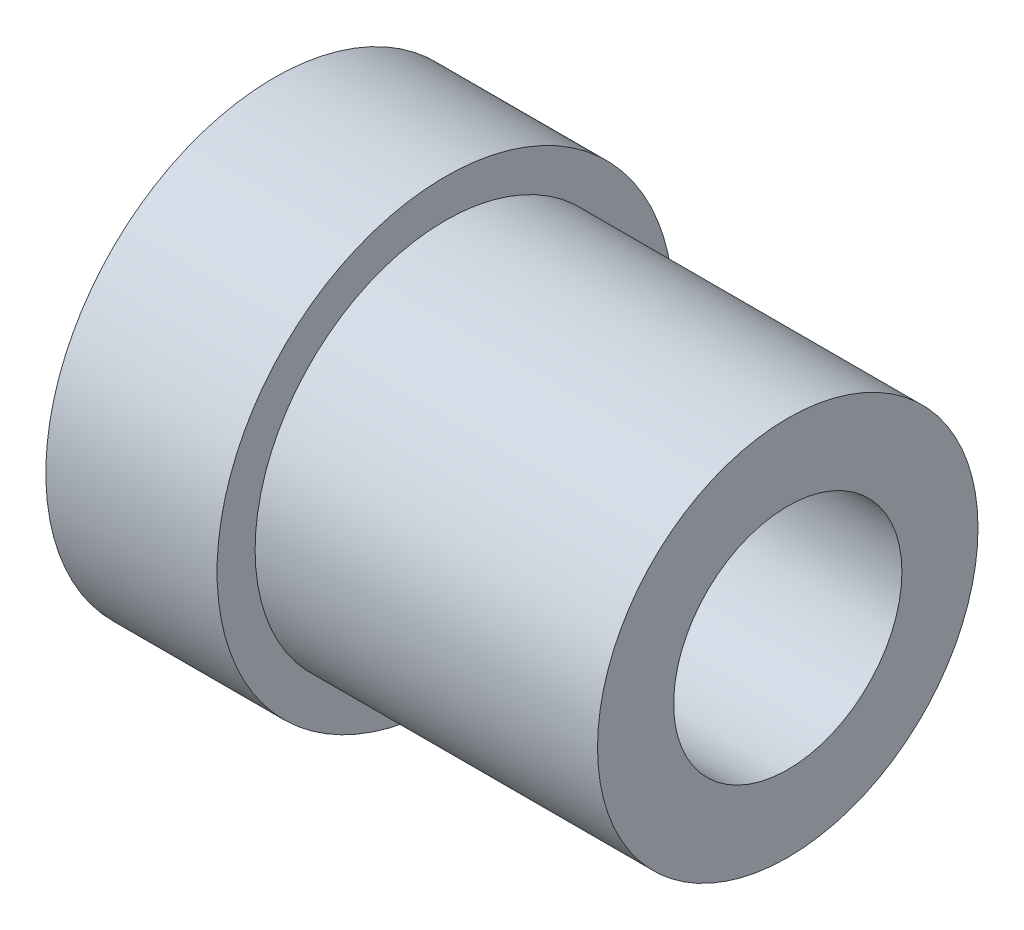
ISO-10303-21;
HEADER;
FILE_DESCRIPTION(('STEP AP214'),'2;1');
FILE_NAME('part.step','',(''),(''),'','','');
FILE_SCHEMA(('AUTOMOTIVE_DESIGN { 1 0 10303 214 1 1 1 1 }'));
ENDSEC;
DATA;
#1=APPLICATION_CONTEXT('core data for automotive mechanical design processes');
#2=APPLICATION_PROTOCOL_DEFINITION('international standard','automotive_design',2000,#1);
#3=PRODUCT_CONTEXT('',#1,'mechanical');
#4=PRODUCT('Part','Part','',(#3));
#5=PRODUCT_RELATED_PRODUCT_CATEGORY('part','',(#4));
#6=PRODUCT_DEFINITION_FORMATION('','',#4);
#7=PRODUCT_DEFINITION_CONTEXT('part definition',#1,'design');
#8=PRODUCT_DEFINITION('design','',#6,#7);
#9=PRODUCT_DEFINITION_SHAPE('','',#8);
#10=(LENGTH_UNIT() NAMED_UNIT(*) SI_UNIT(.MILLI.,.METRE.));
#11=(NAMED_UNIT(*) PLANE_ANGLE_UNIT() SI_UNIT($,.RADIAN.));
#12=(NAMED_UNIT(*) SI_UNIT($,.STERADIAN.) SOLID_ANGLE_UNIT());
#13=UNCERTAINTY_MEASURE_WITH_UNIT(LENGTH_MEASURE(1.E-05),#10,'distance_accuracy_value','');
#14=(GEOMETRIC_REPRESENTATION_CONTEXT(3) GLOBAL_UNCERTAINTY_ASSIGNED_CONTEXT((#13)) GLOBAL_UNIT_ASSIGNED_CONTEXT((#10,
#11,#12)) REPRESENTATION_CONTEXT('',''));
#15=CARTESIAN_POINT('',(0.,0.,0.));
#16=DIRECTION('',(0.,0.,1.));
#17=DIRECTION('',(1.,0.,0.));
#18=AXIS2_PLACEMENT_3D('',#15,#16,#17);
#19=CARTESIAN_POINT('',(4.5,0.,0.));
#20=DIRECTION('',(1.,0.,0.));
#21=DIRECTION('',(0.,0.,-1.));
#22=AXIS2_PLACEMENT_3D('',#19,#20,#21);
#23=PLANE('',#22);
#24=CARTESIAN_POINT('',(4.5,0.,0.));
#25=DIRECTION('',(1.,0.,0.));
#26=DIRECTION('',(0.,0.,-1.));
#27=AXIS2_PLACEMENT_3D('',#24,#25,#26);
#28=CIRCLE('',#27,5.);
#29=CARTESIAN_POINT('',(4.5,0.,-5.));
#30=VERTEX_POINT('',#29);
#31=EDGE_CURVE('E10',#30,#30,#28,.T.);
#32=ORIENTED_EDGE('',*,*,#31,.F.);
#33=EDGE_LOOP('',(#32));
#34=FACE_BOUND('',#33,.T.);
#35=CARTESIAN_POINT('',(4.5,0.,0.));
#36=DIRECTION('',(1.,0.,0.));
#37=DIRECTION('',(0.,0.,-1.));
#38=AXIS2_PLACEMENT_3D('',#35,#36,#37);
#39=CIRCLE('',#38,6.);
#40=CARTESIAN_POINT('',(4.5,0.,-6.));
#41=VERTEX_POINT('',#40);
#42=EDGE_CURVE('E48',#41,#41,#39,.T.);
#43=ORIENTED_EDGE('',*,*,#42,.T.);
#44=EDGE_LOOP('',(#43));
#45=FACE_BOUND('',#44,.T.);
#46=ADVANCED_FACE('F39',(#34,#45),#23,.T.);
#47=CARTESIAN_POINT('',(0.,0.,0.));
#48=DIRECTION('',(1.,0.,0.));
#49=DIRECTION('',(0.,0.,-1.));
#50=AXIS2_PLACEMENT_3D('',#47,#48,#49);
#51=PLANE('',#50);
#52=CARTESIAN_POINT('',(0.,0.,0.));
#53=DIRECTION('',(1.,0.,0.));
#54=DIRECTION('',(0.,0.,-1.));
#55=AXIS2_PLACEMENT_3D('',#52,#53,#54);
#56=CIRCLE('',#55,6.);
#57=CARTESIAN_POINT('',(0.,0.,-6.));
#58=VERTEX_POINT('',#57);
#59=EDGE_CURVE('E43',#58,#58,#56,.T.);
#60=ORIENTED_EDGE('',*,*,#59,.F.);
#61=EDGE_LOOP('',(#60));
#62=FACE_BOUND('',#61,.T.);
#63=CARTESIAN_POINT('',(0.,0.,0.));
#64=DIRECTION('',(1.,0.,0.));
#65=DIRECTION('',(0.,0.,-1.));
#66=AXIS2_PLACEMENT_3D('',#63,#64,#65);
#67=CIRCLE('',#66,3.);
#68=CARTESIAN_POINT('',(0.,0.,-3.));
#69=VERTEX_POINT('',#68);
#70=EDGE_CURVE('E58',#69,#69,#67,.T.);
#71=ORIENTED_EDGE('',*,*,#70,.T.);
#72=EDGE_LOOP('',(#71));
#73=FACE_BOUND('',#72,.T.);
#74=ADVANCED_FACE('F89',(#62,#73),#51,.F.);
#75=CARTESIAN_POINT('',(4.5,0.,0.));
#76=DIRECTION('',(-1.,0.,0.));
#77=DIRECTION('',(0.,0.,1.));
#78=AXIS2_PLACEMENT_3D('',#75,#76,#77);
#79=CYLINDRICAL_SURFACE('',#78,6.);
#80=ORIENTED_EDGE('',*,*,#42,.F.);
#81=EDGE_LOOP('',(#80));
#82=FACE_BOUND('',#81,.T.);
#83=ORIENTED_EDGE('',*,*,#59,.T.);
#84=EDGE_LOOP('',(#83));
#85=FACE_BOUND('',#84,.T.);
#86=ADVANCED_FACE('F41',(#82,#85),#79,.T.);
#87=CARTESIAN_POINT('',(4.5,0.,0.));
#88=DIRECTION('',(-1.,0.,0.));
#89=DIRECTION('',(0.,0.,1.));
#90=AXIS2_PLACEMENT_3D('',#87,#88,#89);
#91=CYLINDRICAL_SURFACE('',#90,3.);
#92=ORIENTED_EDGE('',*,*,#70,.F.);
#93=EDGE_LOOP('',(#92));
#94=FACE_BOUND('',#93,.T.);
#95=CARTESIAN_POINT('',(13.5,0.,0.));
#96=DIRECTION('',(1.,0.,0.));
#97=DIRECTION('',(0.,0.,-1.));
#98=AXIS2_PLACEMENT_3D('',#95,#96,#97);
#99=CIRCLE('',#98,3.);
#100=CARTESIAN_POINT('',(13.5,0.,-3.));
#101=VERTEX_POINT('',#100);
#102=EDGE_CURVE('E67',#101,#101,#99,.T.);
#103=ORIENTED_EDGE('',*,*,#102,.T.);
#104=EDGE_LOOP('',(#103));
#105=FACE_BOUND('',#104,.T.);
#106=ADVANCED_FACE('F74',(#94,#105),#91,.F.);
#107=CARTESIAN_POINT('',(13.5,0.,0.));
#108=DIRECTION('',(1.,0.,0.));
#109=DIRECTION('',(0.,0.,-1.));
#110=AXIS2_PLACEMENT_3D('',#107,#108,#109);
#111=PLANE('',#110);
#112=CARTESIAN_POINT('',(13.5,0.,0.));
#113=DIRECTION('',(1.,0.,0.));
#114=DIRECTION('',(0.,0.,-1.));
#115=AXIS2_PLACEMENT_3D('',#112,#113,#114);
#116=CIRCLE('',#115,5.);
#117=CARTESIAN_POINT('',(13.5,0.,-5.));
#118=VERTEX_POINT('',#117);
#119=EDGE_CURVE('E56',#118,#118,#116,.T.);
#120=ORIENTED_EDGE('',*,*,#119,.T.);
#121=EDGE_LOOP('',(#120));
#122=FACE_BOUND('',#121,.T.);
#123=ORIENTED_EDGE('',*,*,#102,.F.);
#124=EDGE_LOOP('',(#123));
#125=FACE_BOUND('',#124,.T.);
#126=ADVANCED_FACE('F76',(#122,#125),#111,.T.);
#127=CARTESIAN_POINT('',(13.5,0.,0.));
#128=DIRECTION('',(-1.,0.,0.));
#129=DIRECTION('',(0.,0.,1.));
#130=AXIS2_PLACEMENT_3D('',#127,#128,#129);
#131=CYLINDRICAL_SURFACE('',#130,5.);
#132=ORIENTED_EDGE('',*,*,#119,.F.);
#133=EDGE_LOOP('',(#132));
#134=FACE_BOUND('',#133,.T.);
#135=ORIENTED_EDGE('',*,*,#31,.T.);
#136=EDGE_LOOP('',(#135));
#137=FACE_BOUND('',#136,.T.);
#138=ADVANCED_FACE('F78',(#134,#137),#131,.T.);
#139=CLOSED_SHELL('',(#46,#74,#86,#106,#126,#138));
#140=MANIFOLD_SOLID_BREP('B2',#139);
#141=ADVANCED_BREP_SHAPE_REPRESENTATION('',(#18,#140),#14);
#142=SHAPE_DEFINITION_REPRESENTATION(#9,#141);
ENDSEC;
END-ISO-10303-21;
